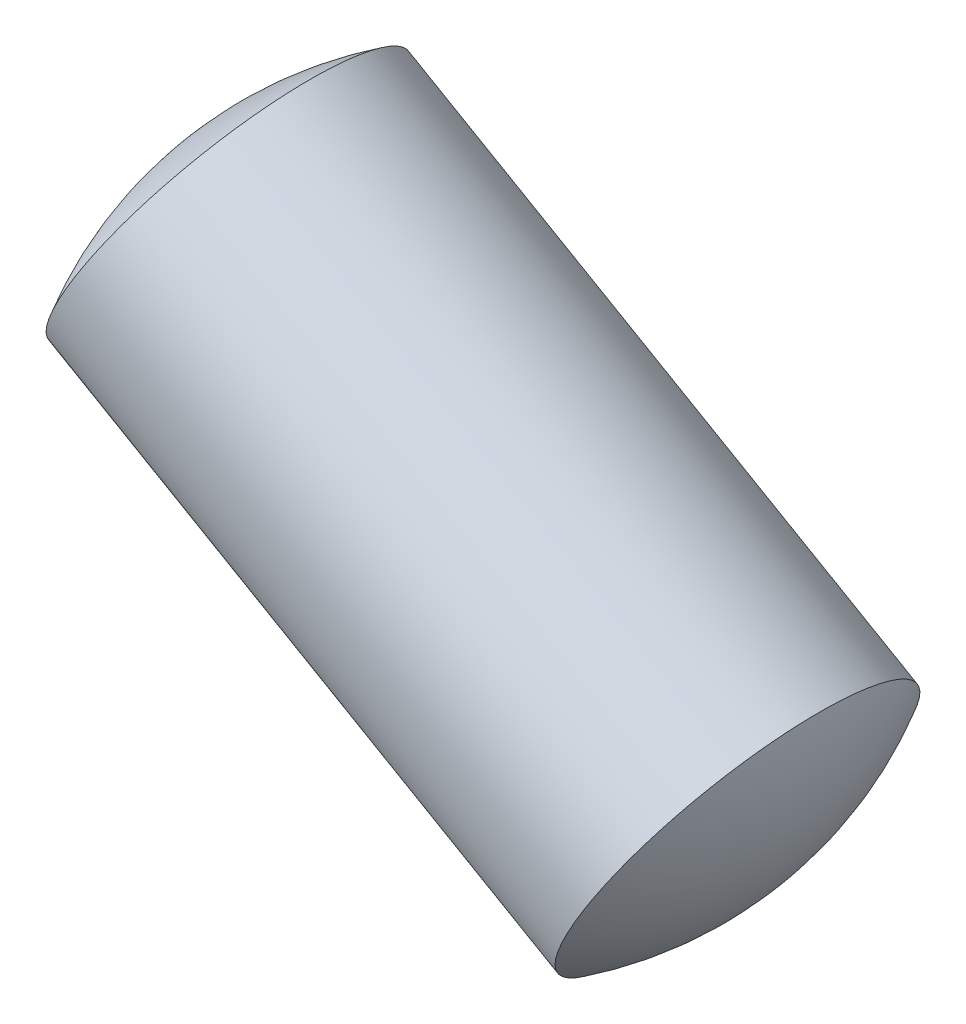
ISO-10303-21;
HEADER;
FILE_DESCRIPTION(('STEP AP214'),'2;1');
FILE_NAME('part.step','',(''),(''),'','','');
FILE_SCHEMA(('AUTOMOTIVE_DESIGN { 1 0 10303 214 1 1 1 1 }'));
ENDSEC;
DATA;
#1=APPLICATION_CONTEXT('core data for automotive mechanical design processes');
#2=APPLICATION_PROTOCOL_DEFINITION('international standard','automotive_design',2000,#1);
#3=PRODUCT_CONTEXT('',#1,'mechanical');
#4=PRODUCT('Part','Part','',(#3));
#5=PRODUCT_RELATED_PRODUCT_CATEGORY('part','',(#4));
#6=PRODUCT_DEFINITION_FORMATION('','',#4);
#7=PRODUCT_DEFINITION_CONTEXT('part definition',#1,'design');
#8=PRODUCT_DEFINITION('design','',#6,#7);
#9=PRODUCT_DEFINITION_SHAPE('','',#8);
#10=(LENGTH_UNIT() NAMED_UNIT(*) SI_UNIT(.MILLI.,.METRE.));
#11=(NAMED_UNIT(*) PLANE_ANGLE_UNIT() SI_UNIT($,.RADIAN.));
#12=(NAMED_UNIT(*) SI_UNIT($,.STERADIAN.) SOLID_ANGLE_UNIT());
#13=UNCERTAINTY_MEASURE_WITH_UNIT(LENGTH_MEASURE(1.E-05),#10,'distance_accuracy_value','');
#14=(GEOMETRIC_REPRESENTATION_CONTEXT(3) GLOBAL_UNCERTAINTY_ASSIGNED_CONTEXT((#13)) GLOBAL_UNIT_ASSIGNED_CONTEXT((#10,
#11,#12)) REPRESENTATION_CONTEXT('',''));
#15=CARTESIAN_POINT('',(0.,0.,0.));
#16=DIRECTION('',(0.,0.,1.));
#17=DIRECTION('',(1.,0.,0.));
#18=AXIS2_PLACEMENT_3D('',#15,#16,#17);
#19=CARTESIAN_POINT('',(23.9039671942901,-13.8009618943233,0.9));
#20=DIRECTION('',(-0.5,-0.866025403784439,0.));
#21=DIRECTION('',(0.866025403784439,-0.5,0.));
#22=AXIS2_PLACEMENT_3D('',#19,#20,#21);
#23=SPHERICAL_SURFACE('',#22,3.);
#24=CARTESIAN_POINT('',(23.9039671942901,-13.8009618943233,0.9));
#25=DIRECTION('',(-0.866025403784439,0.5,0.));
#26=DIRECTION('',(0.,0.,-1.));
#27=AXIS2_PLACEMENT_3D('',#24,#25,#26);
#28=SPHERICAL_SURFACE('',#27,3.);
#29=CARTESIAN_POINT('',(26.1539671942901,-15.1,0.9));
#30=DIRECTION('',(-0.866025403784439,0.5,0.));
#31=DIRECTION('',(0.,0.,-1.));
#32=AXIS2_PLACEMENT_3D('',#29,#30,#31);
#33=CIRCLE('',#32,1.5);
#34=CARTESIAN_POINT('',(26.1539671942901,-15.1,-0.6));
#35=VERTEX_POINT('',#34);
#36=EDGE_CURVE('E11',#35,#35,#33,.T.);
#37=ORIENTED_EDGE('',*,*,#36,.F.);
#38=EDGE_LOOP('',(#37));
#39=FACE_BOUND('',#38,.T.);
#40=ADVANCED_FACE('F17',(#39),#28,.T.);
#41=CARTESIAN_POINT('',(23.7274300138541,-13.6990381056766,0.9));
#42=DIRECTION('',(-0.5,-0.866025403784439,0.));
#43=DIRECTION('',(-0.866025403784439,0.5,0.));
#44=AXIS2_PLACEMENT_3D('',#41,#42,#43);
#45=SPHERICAL_SURFACE('',#44,3.);
#46=CARTESIAN_POINT('',(23.7274300138541,-13.6990381056766,0.9));
#47=DIRECTION('',(-0.866025403784439,0.5,0.));
#48=DIRECTION('',(0.,0.,-1.));
#49=AXIS2_PLACEMENT_3D('',#46,#47,#48);
#50=SPHERICAL_SURFACE('',#49,3.);
#51=CARTESIAN_POINT('',(21.4774300138541,-12.4,0.9));
#52=DIRECTION('',(-0.866025403784439,0.5,0.));
#53=DIRECTION('',(0.,0.,-1.));
#54=AXIS2_PLACEMENT_3D('',#51,#52,#53);
#55=CIRCLE('',#54,1.5);
#56=CARTESIAN_POINT('',(21.4774300138541,-12.4,-0.6));
#57=VERTEX_POINT('',#56);
#58=EDGE_CURVE('E21',#57,#57,#55,.T.);
#59=ORIENTED_EDGE('',*,*,#58,.T.);
#60=EDGE_LOOP('',(#59));
#61=FACE_BOUND('',#60,.T.);
#62=ADVANCED_FACE('F19',(#61),#50,.T.);
#63=CARTESIAN_POINT('',(22.6465643089631,-13.075,0.9));
#64=DIRECTION('',(-0.866025403784439,0.5,0.));
#65=DIRECTION('',(0.,0.,-1.));
#66=AXIS2_PLACEMENT_3D('',#63,#64,#65);
#67=CYLINDRICAL_SURFACE('',#66,1.5);
#68=ORIENTED_EDGE('',*,*,#36,.T.);
#69=EDGE_LOOP('',(#68));
#70=FACE_BOUND('',#69,.T.);
#71=ORIENTED_EDGE('',*,*,#58,.F.);
#72=EDGE_LOOP('',(#71));
#73=FACE_BOUND('',#72,.T.);
#74=ADVANCED_FACE('F57',(#70,#73),#67,.T.);
#75=CLOSED_SHELL('',(#40,#62,#74));
#76=MANIFOLD_SOLID_BREP('B1',#75);
#77=ADVANCED_BREP_SHAPE_REPRESENTATION('',(#18,#76),#14);
#78=SHAPE_DEFINITION_REPRESENTATION(#9,#77);
ENDSEC;
END-ISO-10303-21;
